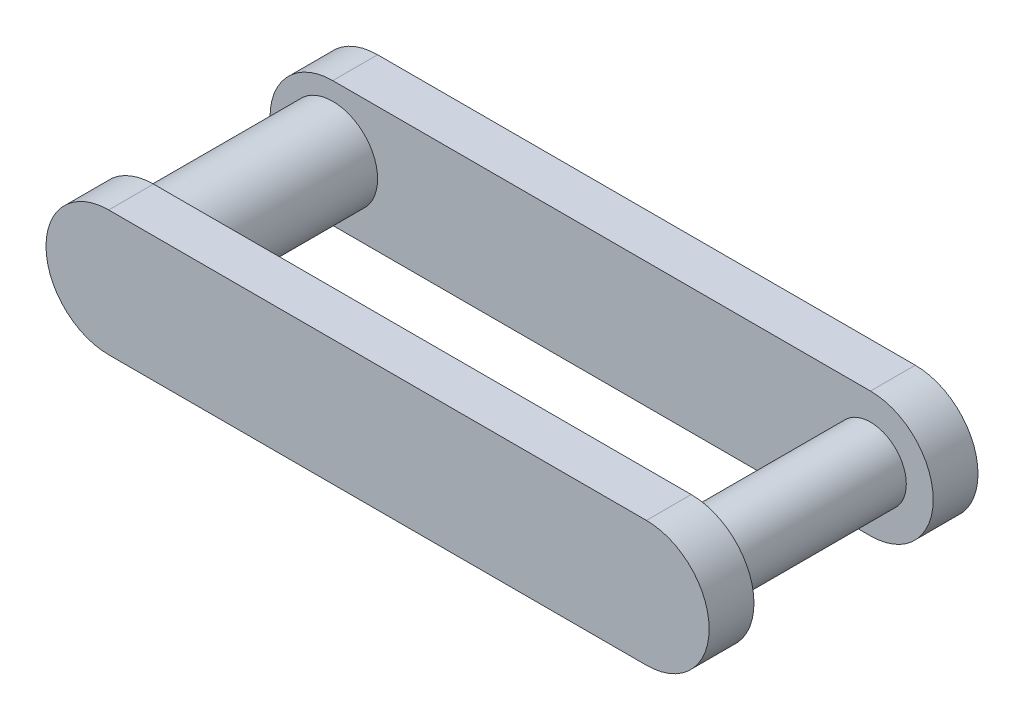
ISO-10303-21;
HEADER;
FILE_DESCRIPTION(('STEP AP214'),'2;1');
FILE_NAME('part.step','',(''),(''),'','','');
FILE_SCHEMA(('AUTOMOTIVE_DESIGN { 1 0 10303 214 1 1 1 1 }'));
ENDSEC;
DATA;
#1=APPLICATION_CONTEXT('core data for automotive mechanical design processes');
#2=APPLICATION_PROTOCOL_DEFINITION('international standard','automotive_design',2000,#1);
#3=PRODUCT_CONTEXT('',#1,'mechanical');
#4=PRODUCT('Part','Part','',(#3));
#5=PRODUCT_RELATED_PRODUCT_CATEGORY('part','',(#4));
#6=PRODUCT_DEFINITION_FORMATION('','',#4);
#7=PRODUCT_DEFINITION_CONTEXT('part definition',#1,'design');
#8=PRODUCT_DEFINITION('design','',#6,#7);
#9=PRODUCT_DEFINITION_SHAPE('','',#8);
#10=(LENGTH_UNIT() NAMED_UNIT(*) SI_UNIT(.MILLI.,.METRE.));
#11=(NAMED_UNIT(*) PLANE_ANGLE_UNIT() SI_UNIT($,.RADIAN.));
#12=(NAMED_UNIT(*) SI_UNIT($,.STERADIAN.) SOLID_ANGLE_UNIT());
#13=UNCERTAINTY_MEASURE_WITH_UNIT(LENGTH_MEASURE(1.E-05),#10,'distance_accuracy_value','');
#14=(GEOMETRIC_REPRESENTATION_CONTEXT(3) GLOBAL_UNCERTAINTY_ASSIGNED_CONTEXT((#13)) GLOBAL_UNIT_ASSIGNED_CONTEXT((#10,
#11,#12)) REPRESENTATION_CONTEXT('',''));
#15=CARTESIAN_POINT('',(0.,0.,0.));
#16=DIRECTION('',(0.,0.,1.));
#17=DIRECTION('',(1.,0.,0.));
#18=AXIS2_PLACEMENT_3D('',#15,#16,#17);
#19=CARTESIAN_POINT('',(-30.,0.,-10.));
#20=DIRECTION('',(0.,0.,1.));
#21=DIRECTION('',(1.,0.,0.));
#22=AXIS2_PLACEMENT_3D('',#19,#20,#21);
#23=CYLINDRICAL_SURFACE('',#22,5.);
#24=CARTESIAN_POINT('',(-30.,0.,-10.));
#25=DIRECTION('',(0.,0.,-1.));
#26=DIRECTION('',(-1.,0.,0.));
#27=AXIS2_PLACEMENT_3D('',#24,#25,#26);
#28=CIRCLE('',#27,5.);
#29=CARTESIAN_POINT('',(-35.,0.,-10.));
#30=VERTEX_POINT('',#29);
#31=EDGE_CURVE('E152',#30,#30,#28,.F.);
#32=ORIENTED_EDGE('',*,*,#31,.T.);
#33=EDGE_LOOP('',(#32));
#34=FACE_BOUND('',#33,.T.);
#35=CARTESIAN_POINT('',(-30.,0.,10.));
#36=DIRECTION('',(0.,0.,1.));
#37=DIRECTION('',(1.,0.,0.));
#38=AXIS2_PLACEMENT_3D('',#35,#36,#37);
#39=CIRCLE('',#38,5.);
#40=CARTESIAN_POINT('',(-25.,0.,10.));
#41=VERTEX_POINT('',#40);
#42=EDGE_CURVE('E11',#41,#41,#39,.T.);
#43=ORIENTED_EDGE('',*,*,#42,.F.);
#44=EDGE_LOOP('',(#43));
#45=FACE_BOUND('',#44,.T.);
#46=ADVANCED_FACE('F32',(#34,#45),#23,.T.);
#47=CARTESIAN_POINT('',(-30.,0.,15.));
#48=DIRECTION('',(0.,0.,-1.));
#49=DIRECTION('',(-1.,0.,0.));
#50=AXIS2_PLACEMENT_3D('',#47,#48,#49);
#51=CYLINDRICAL_SURFACE('',#50,7.);
#52=CARTESIAN_POINT('',(-30.,0.,10.));
#53=DIRECTION('',(0.,0.,1.));
#54=DIRECTION('',(1.,0.,0.));
#55=AXIS2_PLACEMENT_3D('',#52,#53,#54);
#56=CIRCLE('',#55,7.);
#57=CARTESIAN_POINT('',(-30.,7.,10.));
#58=VERTEX_POINT('',#57);
#59=CARTESIAN_POINT('',(-30.,-7.,10.));
#60=VERTEX_POINT('',#59);
#61=EDGE_CURVE('E158',#58,#60,#56,.T.);
#62=ORIENTED_EDGE('',*,*,#61,.T.);
#63=DIRECTION('',(0.,0.,-1.));
#64=VECTOR('',#63,1.);
#65=CARTESIAN_POINT('',(-30.,-7.,15.));
#66=LINE('',#65,#64);
#67=CARTESIAN_POINT('',(-30.,-7.,15.));
#68=VERTEX_POINT('',#67);
#69=EDGE_CURVE('E40',#68,#60,#66,.T.);
#70=ORIENTED_EDGE('',*,*,#69,.F.);
#71=CARTESIAN_POINT('',(-30.,0.,15.));
#72=DIRECTION('',(0.,0.,1.));
#73=DIRECTION('',(1.,0.,0.));
#74=AXIS2_PLACEMENT_3D('',#71,#72,#73);
#75=CIRCLE('',#74,7.);
#76=CARTESIAN_POINT('',(-30.,7.,15.));
#77=VERTEX_POINT('',#76);
#78=EDGE_CURVE('E159',#77,#68,#75,.T.);
#79=ORIENTED_EDGE('',*,*,#78,.F.);
#80=DIRECTION('',(0.,0.,-1.));
#81=VECTOR('',#80,1.);
#82=CARTESIAN_POINT('',(-30.,7.,15.));
#83=LINE('',#82,#81);
#84=EDGE_CURVE('E165',#77,#58,#83,.T.);
#85=ORIENTED_EDGE('',*,*,#84,.T.);
#86=EDGE_LOOP('',(#62,#70,#79,#85));
#87=FACE_BOUND('',#86,.T.);
#88=ADVANCED_FACE('F181',(#87),#51,.T.);
#89=CARTESIAN_POINT('',(-30.,-7.,15.));
#90=DIRECTION('',(0.,1.,0.));
#91=DIRECTION('',(0.,0.,1.));
#92=AXIS2_PLACEMENT_3D('',#89,#90,#91);
#93=PLANE('',#92);
#94=DIRECTION('',(1.,0.,0.));
#95=VECTOR('',#94,1.);
#96=CARTESIAN_POINT('',(-30.,-7.,10.));
#97=LINE('',#96,#95);
#98=CARTESIAN_POINT('',(30.,-7.,10.));
#99=VERTEX_POINT('',#98);
#100=EDGE_CURVE('E168',#60,#99,#97,.T.);
#101=ORIENTED_EDGE('',*,*,#100,.T.);
#102=DIRECTION('',(0.,0.,-1.));
#103=VECTOR('',#102,1.);
#104=CARTESIAN_POINT('',(30.,-7.,15.));
#105=LINE('',#104,#103);
#106=CARTESIAN_POINT('',(30.,-7.,15.));
#107=VERTEX_POINT('',#106);
#108=EDGE_CURVE('E175',#107,#99,#105,.T.);
#109=ORIENTED_EDGE('',*,*,#108,.F.);
#110=DIRECTION('',(1.,0.,0.));
#111=VECTOR('',#110,1.);
#112=CARTESIAN_POINT('',(-30.,-7.,15.));
#113=LINE('',#112,#111);
#114=EDGE_CURVE('E80',#68,#107,#113,.T.);
#115=ORIENTED_EDGE('',*,*,#114,.F.);
#116=ORIENTED_EDGE('',*,*,#69,.T.);
#117=EDGE_LOOP('',(#101,#109,#115,#116));
#118=FACE_BOUND('',#117,.T.);
#119=ADVANCED_FACE('F177',(#118),#93,.F.);
#120=CARTESIAN_POINT('',(30.,0.,15.));
#121=DIRECTION('',(0.,0.,-1.));
#122=DIRECTION('',(-1.,0.,0.));
#123=AXIS2_PLACEMENT_3D('',#120,#121,#122);
#124=CYLINDRICAL_SURFACE('',#123,7.);
#125=CARTESIAN_POINT('',(30.,0.,10.));
#126=DIRECTION('',(0.,0.,1.));
#127=DIRECTION('',(1.,0.,0.));
#128=AXIS2_PLACEMENT_3D('',#125,#126,#127);
#129=CIRCLE('',#128,7.);
#130=CARTESIAN_POINT('',(30.,7.,10.));
#131=VERTEX_POINT('',#130);
#132=EDGE_CURVE('E66',#99,#131,#129,.T.);
#133=ORIENTED_EDGE('',*,*,#132,.T.);
#134=DIRECTION('',(0.,0.,-1.));
#135=VECTOR('',#134,1.);
#136=CARTESIAN_POINT('',(30.,7.,15.));
#137=LINE('',#136,#135);
#138=CARTESIAN_POINT('',(30.,7.,15.));
#139=VERTEX_POINT('',#138);
#140=EDGE_CURVE('E173',#139,#131,#137,.T.);
#141=ORIENTED_EDGE('',*,*,#140,.F.);
#142=CARTESIAN_POINT('',(30.,0.,15.));
#143=DIRECTION('',(0.,0.,1.));
#144=DIRECTION('',(1.,0.,0.));
#145=AXIS2_PLACEMENT_3D('',#142,#143,#144);
#146=CIRCLE('',#145,7.);
#147=EDGE_CURVE('E162',#107,#139,#146,.T.);
#148=ORIENTED_EDGE('',*,*,#147,.F.);
#149=ORIENTED_EDGE('',*,*,#108,.T.);
#150=EDGE_LOOP('',(#133,#141,#148,#149));
#151=FACE_BOUND('',#150,.T.);
#152=ADVANCED_FACE('F283',(#151),#124,.T.);
#153=CARTESIAN_POINT('',(-30.,7.,15.));
#154=DIRECTION('',(0.,-1.,0.));
#155=DIRECTION('',(0.,0.,-1.));
#156=AXIS2_PLACEMENT_3D('',#153,#154,#155);
#157=PLANE('',#156);
#158=DIRECTION('',(-1.,0.,0.));
#159=VECTOR('',#158,1.);
#160=CARTESIAN_POINT('',(-30.,7.,10.));
#161=LINE('',#160,#159);
#162=EDGE_CURVE('E72',#131,#58,#161,.T.);
#163=ORIENTED_EDGE('',*,*,#162,.T.);
#164=ORIENTED_EDGE('',*,*,#84,.F.);
#165=DIRECTION('',(-1.,0.,0.));
#166=VECTOR('',#165,1.);
#167=CARTESIAN_POINT('',(-30.,7.,15.));
#168=LINE('',#167,#166);
#169=EDGE_CURVE('E48',#139,#77,#168,.T.);
#170=ORIENTED_EDGE('',*,*,#169,.F.);
#171=ORIENTED_EDGE('',*,*,#140,.T.);
#172=EDGE_LOOP('',(#163,#164,#170,#171));
#173=FACE_BOUND('',#172,.T.);
#174=ADVANCED_FACE('F195',(#173),#157,.F.);
#175=CARTESIAN_POINT('',(-30.,0.,15.));
#176=DIRECTION('',(0.,0.,1.));
#177=DIRECTION('',(1.,0.,0.));
#178=AXIS2_PLACEMENT_3D('',#175,#176,#177);
#179=PLANE('',#178);
#180=ORIENTED_EDGE('',*,*,#78,.T.);
#181=ORIENTED_EDGE('',*,*,#114,.T.);
#182=ORIENTED_EDGE('',*,*,#147,.T.);
#183=ORIENTED_EDGE('',*,*,#169,.T.);
#184=EDGE_LOOP('',(#180,#181,#182,#183));
#185=FACE_BOUND('',#184,.T.);
#186=ADVANCED_FACE('F186',(#185),#179,.T.);
#187=CARTESIAN_POINT('',(-30.,0.,10.));
#188=DIRECTION('',(0.,0.,1.));
#189=DIRECTION('',(1.,0.,0.));
#190=AXIS2_PLACEMENT_3D('',#187,#188,#189);
#191=PLANE('',#190);
#192=CARTESIAN_POINT('',(30.,0.,10.));
#193=DIRECTION('',(0.,0.,1.));
#194=DIRECTION('',(1.,0.,0.));
#195=AXIS2_PLACEMENT_3D('',#192,#193,#194);
#196=CIRCLE('',#195,4.00000000000001);
#197=CARTESIAN_POINT('',(34.,0.,10.));
#198=VERTEX_POINT('',#197);
#199=EDGE_CURVE('E155',#198,#198,#196,.T.);
#200=ORIENTED_EDGE('',*,*,#199,.T.);
#201=EDGE_LOOP('',(#200));
#202=FACE_BOUND('',#201,.T.);
#203=ORIENTED_EDGE('',*,*,#42,.T.);
#204=EDGE_LOOP('',(#203));
#205=FACE_BOUND('',#204,.T.);
#206=ORIENTED_EDGE('',*,*,#61,.F.);
#207=ORIENTED_EDGE('',*,*,#162,.F.);
#208=ORIENTED_EDGE('',*,*,#132,.F.);
#209=ORIENTED_EDGE('',*,*,#100,.F.);
#210=EDGE_LOOP('',(#206,#207,#208,#209));
#211=FACE_BOUND('',#210,.T.);
#212=ADVANCED_FACE('F183',(#202,#205,#211),#191,.F.);
#213=CARTESIAN_POINT('',(30.,0.,-10.));
#214=DIRECTION('',(0.,0.,1.));
#215=DIRECTION('',(1.,0.,0.));
#216=AXIS2_PLACEMENT_3D('',#213,#214,#215);
#217=CYLINDRICAL_SURFACE('',#216,4.00000000000001);
#218=CARTESIAN_POINT('',(30.,0.,-10.));
#219=DIRECTION('',(0.,0.,-1.));
#220=DIRECTION('',(-1.,0.,0.));
#221=AXIS2_PLACEMENT_3D('',#218,#219,#220);
#222=CIRCLE('',#221,4.00000000000001);
#223=CARTESIAN_POINT('',(26.,0.,-10.));
#224=VERTEX_POINT('',#223);
#225=EDGE_CURVE('E118',#224,#224,#222,.F.);
#226=ORIENTED_EDGE('',*,*,#225,.T.);
#227=EDGE_LOOP('',(#226));
#228=FACE_BOUND('',#227,.T.);
#229=ORIENTED_EDGE('',*,*,#199,.F.);
#230=EDGE_LOOP('',(#229));
#231=FACE_BOUND('',#230,.T.);
#232=ADVANCED_FACE('F185',(#228,#231),#217,.T.);
#233=CARTESIAN_POINT('',(-30.,0.,-15.));
#234=DIRECTION('',(0.,0.,1.));
#235=DIRECTION('',(1.,0.,0.));
#236=AXIS2_PLACEMENT_3D('',#233,#234,#235);
#237=CYLINDRICAL_SURFACE('',#236,7.);
#238=CARTESIAN_POINT('',(-30.,0.,-10.));
#239=DIRECTION('',(0.,0.,1.));
#240=DIRECTION('',(1.,0.,0.));
#241=AXIS2_PLACEMENT_3D('',#238,#239,#240);
#242=CIRCLE('',#241,7.);
#243=CARTESIAN_POINT('',(-30.,7.,-10.));
#244=VERTEX_POINT('',#243);
#245=CARTESIAN_POINT('',(-30.,-7.,-10.));
#246=VERTEX_POINT('',#245);
#247=EDGE_CURVE('E113',#244,#246,#242,.T.);
#248=ORIENTED_EDGE('',*,*,#247,.F.);
#249=DIRECTION('',(0.,0.,1.));
#250=VECTOR('',#249,1.);
#251=CARTESIAN_POINT('',(-30.,7.,-15.));
#252=LINE('',#251,#250);
#253=CARTESIAN_POINT('',(-30.,7.,-15.));
#254=VERTEX_POINT('',#253);
#255=EDGE_CURVE('E107',#254,#244,#252,.T.);
#256=ORIENTED_EDGE('',*,*,#255,.F.);
#257=CARTESIAN_POINT('',(-30.,0.,-15.));
#258=DIRECTION('',(0.,0.,1.));
#259=DIRECTION('',(1.,0.,0.));
#260=AXIS2_PLACEMENT_3D('',#257,#258,#259);
#261=CIRCLE('',#260,7.);
#262=CARTESIAN_POINT('',(-30.,-7.,-15.));
#263=VERTEX_POINT('',#262);
#264=EDGE_CURVE('E110',#254,#263,#261,.T.);
#265=ORIENTED_EDGE('',*,*,#264,.T.);
#266=DIRECTION('',(0.,0.,1.));
#267=VECTOR('',#266,1.);
#268=CARTESIAN_POINT('',(-30.,-7.,-15.));
#269=LINE('',#268,#267);
#270=EDGE_CURVE('E137',#263,#246,#269,.T.);
#271=ORIENTED_EDGE('',*,*,#270,.T.);
#272=EDGE_LOOP('',(#248,#256,#265,#271));
#273=FACE_BOUND('',#272,.T.);
#274=ADVANCED_FACE('F109',(#273),#237,.T.);
#275=CARTESIAN_POINT('',(-30.,7.,-15.));
#276=DIRECTION('',(0.,1.,0.));
#277=DIRECTION('',(0.,0.,1.));
#278=AXIS2_PLACEMENT_3D('',#275,#276,#277);
#279=PLANE('',#278);
#280=DIRECTION('',(-1.,0.,0.));
#281=VECTOR('',#280,1.);
#282=CARTESIAN_POINT('',(-30.,7.,-10.));
#283=LINE('',#282,#281);
#284=CARTESIAN_POINT('',(30.,7.,-10.));
#285=VERTEX_POINT('',#284);
#286=EDGE_CURVE('E139',#285,#244,#283,.T.);
#287=ORIENTED_EDGE('',*,*,#286,.F.);
#288=DIRECTION('',(0.,0.,1.));
#289=VECTOR('',#288,1.);
#290=CARTESIAN_POINT('',(30.,7.,-15.));
#291=LINE('',#290,#289);
#292=CARTESIAN_POINT('',(30.,7.,-15.));
#293=VERTEX_POINT('',#292);
#294=EDGE_CURVE('E119',#293,#285,#291,.T.);
#295=ORIENTED_EDGE('',*,*,#294,.F.);
#296=DIRECTION('',(-1.,0.,0.));
#297=VECTOR('',#296,1.);
#298=CARTESIAN_POINT('',(-30.,7.,-15.));
#299=LINE('',#298,#297);
#300=EDGE_CURVE('E125',#293,#254,#299,.T.);
#301=ORIENTED_EDGE('',*,*,#300,.T.);
#302=ORIENTED_EDGE('',*,*,#255,.T.);
#303=EDGE_LOOP('',(#287,#295,#301,#302));
#304=FACE_BOUND('',#303,.T.);
#305=ADVANCED_FACE('F131',(#304),#279,.T.);
#306=CARTESIAN_POINT('',(30.,0.,-15.));
#307=DIRECTION('',(0.,0.,1.));
#308=DIRECTION('',(1.,0.,0.));
#309=AXIS2_PLACEMENT_3D('',#306,#307,#308);
#310=CYLINDRICAL_SURFACE('',#309,7.);
#311=CARTESIAN_POINT('',(30.,0.,-10.));
#312=DIRECTION('',(0.,0.,1.));
#313=DIRECTION('',(1.,0.,0.));
#314=AXIS2_PLACEMENT_3D('',#311,#312,#313);
#315=CIRCLE('',#314,7.);
#316=CARTESIAN_POINT('',(30.,-7.,-10.));
#317=VERTEX_POINT('',#316);
#318=EDGE_CURVE('E141',#317,#285,#315,.T.);
#319=ORIENTED_EDGE('',*,*,#318,.F.);
#320=DIRECTION('',(0.,0.,1.));
#321=VECTOR('',#320,1.);
#322=CARTESIAN_POINT('',(30.,-7.,-15.));
#323=LINE('',#322,#321);
#324=CARTESIAN_POINT('',(30.,-7.,-15.));
#325=VERTEX_POINT('',#324);
#326=EDGE_CURVE('E147',#325,#317,#323,.T.);
#327=ORIENTED_EDGE('',*,*,#326,.F.);
#328=CARTESIAN_POINT('',(30.,0.,-15.));
#329=DIRECTION('',(0.,0.,1.));
#330=DIRECTION('',(1.,0.,0.));
#331=AXIS2_PLACEMENT_3D('',#328,#329,#330);
#332=CIRCLE('',#331,7.);
#333=EDGE_CURVE('E132',#325,#293,#332,.T.);
#334=ORIENTED_EDGE('',*,*,#333,.T.);
#335=ORIENTED_EDGE('',*,*,#294,.T.);
#336=EDGE_LOOP('',(#319,#327,#334,#335));
#337=FACE_BOUND('',#336,.T.);
#338=ADVANCED_FACE('F219',(#337),#310,.T.);
#339=CARTESIAN_POINT('',(-30.,-7.,-15.));
#340=DIRECTION('',(0.,-1.,0.));
#341=DIRECTION('',(0.,0.,-1.));
#342=AXIS2_PLACEMENT_3D('',#339,#340,#341);
#343=PLANE('',#342);
#344=DIRECTION('',(1.,0.,0.));
#345=VECTOR('',#344,1.);
#346=CARTESIAN_POINT('',(-30.,-7.,-10.));
#347=LINE('',#346,#345);
#348=EDGE_CURVE('E129',#246,#317,#347,.T.);
#349=ORIENTED_EDGE('',*,*,#348,.F.);
#350=ORIENTED_EDGE('',*,*,#270,.F.);
#351=DIRECTION('',(1.,0.,0.));
#352=VECTOR('',#351,1.);
#353=CARTESIAN_POINT('',(-30.,-7.,-15.));
#354=LINE('',#353,#352);
#355=EDGE_CURVE('E128',#263,#325,#354,.T.);
#356=ORIENTED_EDGE('',*,*,#355,.T.);
#357=ORIENTED_EDGE('',*,*,#326,.T.);
#358=EDGE_LOOP('',(#349,#350,#356,#357));
#359=FACE_BOUND('',#358,.T.);
#360=ADVANCED_FACE('F216',(#359),#343,.T.);
#361=CARTESIAN_POINT('',(-30.,0.,-15.));
#362=DIRECTION('',(0.,0.,-1.));
#363=DIRECTION('',(1.,0.,0.));
#364=AXIS2_PLACEMENT_3D('',#361,#362,#363);
#365=PLANE('',#364);
#366=ORIENTED_EDGE('',*,*,#264,.F.);
#367=ORIENTED_EDGE('',*,*,#300,.F.);
#368=ORIENTED_EDGE('',*,*,#333,.F.);
#369=ORIENTED_EDGE('',*,*,#355,.F.);
#370=EDGE_LOOP('',(#366,#367,#368,#369));
#371=FACE_BOUND('',#370,.T.);
#372=ADVANCED_FACE('F123',(#371),#365,.T.);
#373=CARTESIAN_POINT('',(-30.,0.,-10.));
#374=DIRECTION('',(0.,0.,-1.));
#375=DIRECTION('',(1.,0.,0.));
#376=AXIS2_PLACEMENT_3D('',#373,#374,#375);
#377=PLANE('',#376);
#378=ORIENTED_EDGE('',*,*,#31,.F.);
#379=EDGE_LOOP('',(#378));
#380=FACE_BOUND('',#379,.T.);
#381=ORIENTED_EDGE('',*,*,#225,.F.);
#382=EDGE_LOOP('',(#381));
#383=FACE_BOUND('',#382,.T.);
#384=ORIENTED_EDGE('',*,*,#247,.T.);
#385=ORIENTED_EDGE('',*,*,#348,.T.);
#386=ORIENTED_EDGE('',*,*,#318,.T.);
#387=ORIENTED_EDGE('',*,*,#286,.T.);
#388=EDGE_LOOP('',(#384,#385,#386,#387));
#389=FACE_BOUND('',#388,.T.);
#390=ADVANCED_FACE('F208',(#380,#383,#389),#377,.F.);
#391=CLOSED_SHELL('',(#46,#88,#119,#152,#174,#186,#212,#232,#274,#305,#338,#360,#372,#390));
#392=MANIFOLD_SOLID_BREP('B2',#391);
#393=ADVANCED_BREP_SHAPE_REPRESENTATION('',(#18,#392),#14);
#394=SHAPE_DEFINITION_REPRESENTATION(#9,#393);
ENDSEC;
END-ISO-10303-21;
